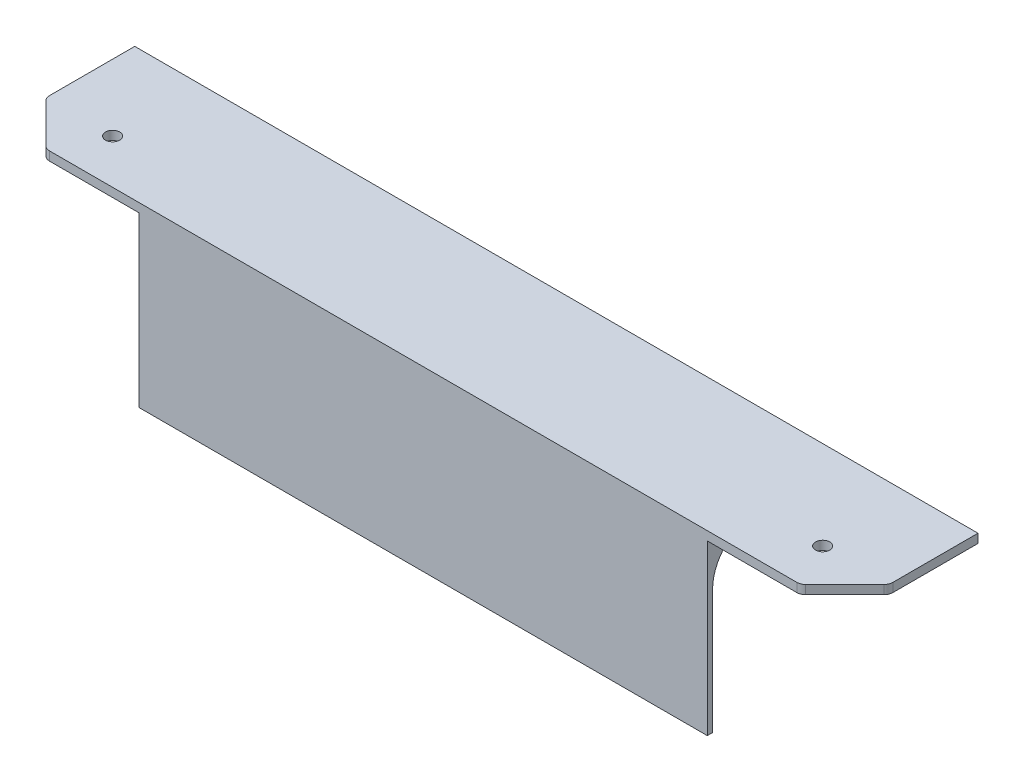
ISO-10303-21;
HEADER;
FILE_DESCRIPTION(('STEP AP214'),'2;1');
FILE_NAME('part.step','',(''),(''),'','','');
FILE_SCHEMA(('AUTOMOTIVE_DESIGN { 1 0 10303 214 1 1 1 1 }'));
ENDSEC;
DATA;
#1=APPLICATION_CONTEXT('core data for automotive mechanical design processes');
#2=APPLICATION_PROTOCOL_DEFINITION('international standard','automotive_design',2000,#1);
#3=PRODUCT_CONTEXT('',#1,'mechanical');
#4=PRODUCT('Part','Part','',(#3));
#5=PRODUCT_RELATED_PRODUCT_CATEGORY('part','',(#4));
#6=PRODUCT_DEFINITION_FORMATION('','',#4);
#7=PRODUCT_DEFINITION_CONTEXT('part definition',#1,'design');
#8=PRODUCT_DEFINITION('design','',#6,#7);
#9=PRODUCT_DEFINITION_SHAPE('','',#8);
#10=(LENGTH_UNIT() NAMED_UNIT(*) SI_UNIT(.MILLI.,.METRE.));
#11=(NAMED_UNIT(*) PLANE_ANGLE_UNIT() SI_UNIT($,.RADIAN.));
#12=(NAMED_UNIT(*) SI_UNIT($,.STERADIAN.) SOLID_ANGLE_UNIT());
#13=UNCERTAINTY_MEASURE_WITH_UNIT(LENGTH_MEASURE(1.E-05),#10,'distance_accuracy_value','');
#14=(GEOMETRIC_REPRESENTATION_CONTEXT(3) GLOBAL_UNCERTAINTY_ASSIGNED_CONTEXT((#13)) GLOBAL_UNIT_ASSIGNED_CONTEXT((#10,
#11,#12)) REPRESENTATION_CONTEXT('',''));
#15=CARTESIAN_POINT('',(0.,0.,0.));
#16=DIRECTION('',(0.,0.,1.));
#17=DIRECTION('',(1.,0.,0.));
#18=AXIS2_PLACEMENT_3D('',#15,#16,#17);
#19=CARTESIAN_POINT('',(95.,2.,15.));
#20=DIRECTION('',(-1.,0.,0.));
#21=DIRECTION('',(0.,0.,1.));
#22=AXIS2_PLACEMENT_3D('',#19,#20,#21);
#23=PLANE('',#22);
#24=DIRECTION('',(0.,0.,-1.));
#25=VECTOR('',#24,1.);
#26=CARTESIAN_POINT('',(95.,2.,15.));
#27=LINE('',#26,#25);
#28=CARTESIAN_POINT('',(95.,2.,4.17157287525383));
#29=VERTEX_POINT('',#28);
#30=CARTESIAN_POINT('',(95.,2.,-15.));
#31=VERTEX_POINT('',#30);
#32=EDGE_CURVE('E188',#29,#31,#27,.T.);
#33=ORIENTED_EDGE('',*,*,#32,.F.);
#34=DIRECTION('',(0.,1.,0.));
#35=VECTOR('',#34,1.);
#36=CARTESIAN_POINT('',(95.,0.,4.17157287525383));
#37=LINE('',#36,#35);
#38=CARTESIAN_POINT('',(95.,0.,4.17157287525383));
#39=VERTEX_POINT('',#38);
#40=EDGE_CURVE('E278',#29,#39,#37,.F.);
#41=ORIENTED_EDGE('',*,*,#40,.T.);
#42=DIRECTION('',(0.,0.,-1.));
#43=VECTOR('',#42,1.);
#44=CARTESIAN_POINT('',(95.,0.,15.));
#45=LINE('',#44,#43);
#46=CARTESIAN_POINT('',(95.,0.,-15.));
#47=VERTEX_POINT('',#46);
#48=EDGE_CURVE('E178',#39,#47,#45,.T.);
#49=ORIENTED_EDGE('',*,*,#48,.T.);
#50=DIRECTION('',(0.,-1.,0.));
#51=VECTOR('',#50,1.);
#52=CARTESIAN_POINT('',(95.,2.,-15.));
#53=LINE('',#52,#51);
#54=EDGE_CURVE('E216',#31,#47,#53,.T.);
#55=ORIENTED_EDGE('',*,*,#54,.F.);
#56=EDGE_LOOP('',(#33,#41,#49,#55));
#57=FACE_BOUND('',#56,.T.);
#58=ADVANCED_FACE('F45',(#57),#23,.F.);
#59=CARTESIAN_POINT('',(-95.,2.,-15.));
#60=DIRECTION('',(0.,0.,1.));
#61=DIRECTION('',(1.,0.,0.));
#62=AXIS2_PLACEMENT_3D('',#59,#60,#61);
#63=PLANE('',#62);
#64=DIRECTION('',(-1.,0.,0.));
#65=VECTOR('',#64,1.);
#66=CARTESIAN_POINT('',(-95.,0.,-15.));
#67=LINE('',#66,#65);
#68=CARTESIAN_POINT('',(-95.,0.,-15.));
#69=VERTEX_POINT('',#68);
#70=EDGE_CURVE('E182',#47,#69,#67,.T.);
#71=ORIENTED_EDGE('',*,*,#70,.T.);
#72=DIRECTION('',(0.,-1.,0.));
#73=VECTOR('',#72,1.);
#74=CARTESIAN_POINT('',(-95.,2.,-15.));
#75=LINE('',#74,#73);
#76=CARTESIAN_POINT('',(-95.,2.,-15.));
#77=VERTEX_POINT('',#76);
#78=EDGE_CURVE('E202',#77,#69,#75,.T.);
#79=ORIENTED_EDGE('',*,*,#78,.F.);
#80=DIRECTION('',(-1.,0.,0.));
#81=VECTOR('',#80,1.);
#82=CARTESIAN_POINT('',(-95.,2.,-15.));
#83=LINE('',#82,#81);
#84=EDGE_CURVE('E191',#31,#77,#83,.T.);
#85=ORIENTED_EDGE('',*,*,#84,.F.);
#86=ORIENTED_EDGE('',*,*,#54,.T.);
#87=EDGE_LOOP('',(#71,#79,#85,#86));
#88=FACE_BOUND('',#87,.T.);
#89=ADVANCED_FACE('F374',(#88),#63,.F.);
#90=CARTESIAN_POINT('',(-95.,2.,15.));
#91=DIRECTION('',(1.,0.,0.));
#92=DIRECTION('',(0.,0.,-1.));
#93=AXIS2_PLACEMENT_3D('',#90,#91,#92);
#94=PLANE('',#93);
#95=DIRECTION('',(0.,0.,1.));
#96=VECTOR('',#95,1.);
#97=CARTESIAN_POINT('',(-95.,0.,15.));
#98=LINE('',#97,#96);
#99=CARTESIAN_POINT('',(-95.,0.,4.17157287525377));
#100=VERTEX_POINT('',#99);
#101=EDGE_CURVE('E206',#69,#100,#98,.T.);
#102=ORIENTED_EDGE('',*,*,#101,.T.);
#103=DIRECTION('',(0.,-1.,0.));
#104=VECTOR('',#103,1.);
#105=CARTESIAN_POINT('',(-95.,2.,4.17157287525377));
#106=LINE('',#105,#104);
#107=CARTESIAN_POINT('',(-95.,2.,4.17157287525377));
#108=VERTEX_POINT('',#107);
#109=EDGE_CURVE('E274',#100,#108,#106,.F.);
#110=ORIENTED_EDGE('',*,*,#109,.T.);
#111=DIRECTION('',(0.,0.,1.));
#112=VECTOR('',#111,1.);
#113=CARTESIAN_POINT('',(-95.,2.,15.));
#114=LINE('',#113,#112);
#115=EDGE_CURVE('E195',#77,#108,#114,.T.);
#116=ORIENTED_EDGE('',*,*,#115,.F.);
#117=ORIENTED_EDGE('',*,*,#78,.T.);
#118=EDGE_LOOP('',(#102,#110,#116,#117));
#119=FACE_BOUND('',#118,.T.);
#120=ADVANCED_FACE('F378',(#119),#94,.F.);
#121=CARTESIAN_POINT('',(-95.,2.,15.));
#122=DIRECTION('',(0.,0.,-1.));
#123=DIRECTION('',(-1.,0.,0.));
#124=AXIS2_PLACEMENT_3D('',#121,#122,#123);
#125=PLANE('',#124);
#126=DIRECTION('',(1.,0.,0.));
#127=VECTOR('',#126,1.);
#128=CARTESIAN_POINT('',(-95.,2.,15.));
#129=LINE('',#128,#127);
#130=CARTESIAN_POINT('',(-84.1715728752538,2.,15.));
#131=VERTEX_POINT('',#130);
#132=CARTESIAN_POINT('',(84.1715728752538,2.,15.));
#133=VERTEX_POINT('',#132);
#134=EDGE_CURVE('E199',#131,#133,#129,.T.);
#135=ORIENTED_EDGE('',*,*,#134,.F.);
#136=DIRECTION('',(0.,1.,0.));
#137=VECTOR('',#136,1.);
#138=CARTESIAN_POINT('',(-84.1715728752538,0.,15.));
#139=LINE('',#138,#137);
#140=CARTESIAN_POINT('',(-84.1715728752538,0.,15.));
#141=VERTEX_POINT('',#140);
#142=EDGE_CURVE('E240',#131,#141,#139,.F.);
#143=ORIENTED_EDGE('',*,*,#142,.T.);
#144=DIRECTION('',(1.,0.,0.));
#145=VECTOR('',#144,1.);
#146=CARTESIAN_POINT('',(-95.,0.,15.));
#147=LINE('',#146,#145);
#148=CARTESIAN_POINT('',(-64.,0.,15.));
#149=VERTEX_POINT('',#148);
#150=EDGE_CURVE('E192',#141,#149,#147,.T.);
#151=ORIENTED_EDGE('',*,*,#150,.T.);
#152=DIRECTION('',(0.,1.,0.));
#153=VECTOR('',#152,1.);
#154=CARTESIAN_POINT('',(-64.,-38.,15.));
#155=LINE('',#154,#153);
#156=CARTESIAN_POINT('',(-64.,-38.,15.));
#157=VERTEX_POINT('',#156);
#158=EDGE_CURVE('E313',#157,#149,#155,.T.);
#159=ORIENTED_EDGE('',*,*,#158,.F.);
#160=DIRECTION('',(-1.,0.,0.));
#161=VECTOR('',#160,1.);
#162=CARTESIAN_POINT('',(-64.,-38.,15.));
#163=LINE('',#162,#161);
#164=CARTESIAN_POINT('',(64.,-38.,15.));
#165=VERTEX_POINT('',#164);
#166=EDGE_CURVE('E171',#165,#157,#163,.T.);
#167=ORIENTED_EDGE('',*,*,#166,.F.);
#168=DIRECTION('',(0.,1.,0.));
#169=VECTOR('',#168,1.);
#170=CARTESIAN_POINT('',(64.,-38.,15.));
#171=LINE('',#170,#169);
#172=CARTESIAN_POINT('',(64.,0.,15.));
#173=VERTEX_POINT('',#172);
#174=EDGE_CURVE('E184',#165,#173,#171,.T.);
#175=ORIENTED_EDGE('',*,*,#174,.T.);
#176=CARTESIAN_POINT('',(84.1715728752538,0.,15.));
#177=VERTEX_POINT('',#176);
#178=EDGE_CURVE('E210',#173,#177,#147,.T.);
#179=ORIENTED_EDGE('',*,*,#178,.T.);
#180=DIRECTION('',(0.,-1.,0.));
#181=VECTOR('',#180,1.);
#182=CARTESIAN_POINT('',(84.1715728752538,2.,15.));
#183=LINE('',#182,#181);
#184=EDGE_CURVE('E236',#177,#133,#183,.F.);
#185=ORIENTED_EDGE('',*,*,#184,.T.);
#186=EDGE_LOOP('',(#135,#143,#151,#159,#167,#175,#179,#185));
#187=FACE_BOUND('',#186,.T.);
#188=ADVANCED_FACE('F338',(#187),#125,.F.);
#189=CARTESIAN_POINT('',(0.,2.,0.));
#190=DIRECTION('',(0.,-1.,0.));
#191=DIRECTION('',(0.,0.,-1.));
#192=AXIS2_PLACEMENT_3D('',#189,#190,#191);
#193=PLANE('',#192);
#194=CARTESIAN_POINT('',(-80.,2.,5.));
#195=DIRECTION('',(0.,1.,0.));
#196=DIRECTION('',(0.,0.,1.));
#197=AXIS2_PLACEMENT_3D('',#194,#195,#196);
#198=CIRCLE('',#197,1.60000000000001);
#199=CARTESIAN_POINT('',(-80.,2.,6.6));
#200=VERTEX_POINT('',#199);
#201=EDGE_CURVE('E294',#200,#200,#198,.T.);
#202=ORIENTED_EDGE('',*,*,#201,.F.);
#203=EDGE_LOOP('',(#202));
#204=FACE_BOUND('',#203,.T.);
#205=CARTESIAN_POINT('',(80.,2.,5.));
#206=DIRECTION('',(0.,1.,0.));
#207=DIRECTION('',(0.,0.,1.));
#208=AXIS2_PLACEMENT_3D('',#205,#206,#207);
#209=CIRCLE('',#208,1.60000000000001);
#210=CARTESIAN_POINT('',(80.,2.,6.6));
#211=VERTEX_POINT('',#210);
#212=EDGE_CURVE('E325',#211,#211,#209,.T.);
#213=ORIENTED_EDGE('',*,*,#212,.F.);
#214=EDGE_LOOP('',(#213));
#215=FACE_BOUND('',#214,.T.);
#216=DIRECTION('',(-0.707106781186546,0.,-0.70710678118655));
#217=VECTOR('',#216,1.);
#218=CARTESIAN_POINT('',(-85.,2.,15.));
#219=LINE('',#218,#217);
#220=CARTESIAN_POINT('',(-94.4142135623731,2.,5.58578643762686));
#221=VERTEX_POINT('',#220);
#222=CARTESIAN_POINT('',(-85.5857864376269,2.,14.4142135623731));
#223=VERTEX_POINT('',#222);
#224=EDGE_CURVE('E228',#221,#223,#219,.F.);
#225=ORIENTED_EDGE('',*,*,#224,.T.);
#226=CARTESIAN_POINT('',(-84.1715728752538,2.,13.));
#227=DIRECTION('',(0.,-1.,0.));
#228=DIRECTION('',(0.,0.,-1.));
#229=AXIS2_PLACEMENT_3D('',#226,#227,#228);
#230=CIRCLE('',#229,2.);
#231=EDGE_CURVE('E271',#223,#131,#230,.F.);
#232=ORIENTED_EDGE('',*,*,#231,.T.);
#233=ORIENTED_EDGE('',*,*,#134,.T.);
#234=CARTESIAN_POINT('',(84.1715728752538,2.,13.));
#235=DIRECTION('',(0.,-1.,0.));
#236=DIRECTION('',(0.,0.,-1.));
#237=AXIS2_PLACEMENT_3D('',#234,#235,#236);
#238=CIRCLE('',#237,2.);
#239=CARTESIAN_POINT('',(85.5857864376269,2.,14.4142135623731));
#240=VERTEX_POINT('',#239);
#241=EDGE_CURVE('E262',#133,#240,#238,.F.);
#242=ORIENTED_EDGE('',*,*,#241,.T.);
#243=DIRECTION('',(-0.70710678118655,0.,0.707106781186546));
#244=VECTOR('',#243,1.);
#245=CARTESIAN_POINT('',(95.,2.,5.00000000000002));
#246=LINE('',#245,#244);
#247=CARTESIAN_POINT('',(94.4142135623731,2.,5.58578643762692));
#248=VERTEX_POINT('',#247);
#249=EDGE_CURVE('E232',#240,#248,#246,.F.);
#250=ORIENTED_EDGE('',*,*,#249,.T.);
#251=CARTESIAN_POINT('',(93.,2.,4.17157287525383));
#252=DIRECTION('',(0.,-1.,0.));
#253=DIRECTION('',(0.,0.,-1.));
#254=AXIS2_PLACEMENT_3D('',#251,#252,#253);
#255=CIRCLE('',#254,2.);
#256=EDGE_CURVE('E265',#248,#29,#255,.F.);
#257=ORIENTED_EDGE('',*,*,#256,.T.);
#258=ORIENTED_EDGE('',*,*,#32,.T.);
#259=ORIENTED_EDGE('',*,*,#84,.T.);
#260=ORIENTED_EDGE('',*,*,#115,.T.);
#261=CARTESIAN_POINT('',(-93.,2.,4.17157287525377));
#262=DIRECTION('',(0.,-1.,0.));
#263=DIRECTION('',(0.,0.,-1.));
#264=AXIS2_PLACEMENT_3D('',#261,#262,#263);
#265=CIRCLE('',#264,2.);
#266=EDGE_CURVE('E268',#108,#221,#265,.F.);
#267=ORIENTED_EDGE('',*,*,#266,.T.);
#268=EDGE_LOOP('',(#225,#232,#233,#242,#250,#257,#258,#259,#260,#267));
#269=FACE_BOUND('',#268,.T.);
#270=ADVANCED_FACE('F335',(#204,#215,#269),#193,.F.);
#271=CARTESIAN_POINT('',(0.,0.,0.));
#272=DIRECTION('',(0.,-1.,0.));
#273=DIRECTION('',(0.,0.,-1.));
#274=AXIS2_PLACEMENT_3D('',#271,#272,#273);
#275=PLANE('',#274);
#276=CARTESIAN_POINT('',(-80.,0.,5.));
#277=DIRECTION('',(0.,-1.,0.));
#278=DIRECTION('',(0.,0.,-1.));
#279=AXIS2_PLACEMENT_3D('',#276,#277,#278);
#280=CIRCLE('',#279,1.60000000000001);
#281=CARTESIAN_POINT('',(-80.,0.,3.39999999999999));
#282=VERTEX_POINT('',#281);
#283=EDGE_CURVE('E293',#282,#282,#280,.T.);
#284=ORIENTED_EDGE('',*,*,#283,.F.);
#285=EDGE_LOOP('',(#284));
#286=FACE_BOUND('',#285,.T.);
#287=CARTESIAN_POINT('',(80.,0.,5.));
#288=DIRECTION('',(0.,-1.,0.));
#289=DIRECTION('',(0.,0.,-1.));
#290=AXIS2_PLACEMENT_3D('',#287,#288,#289);
#291=CIRCLE('',#290,1.60000000000001);
#292=CARTESIAN_POINT('',(80.,0.,3.39999999999999));
#293=VERTEX_POINT('',#292);
#294=EDGE_CURVE('E289',#293,#293,#291,.T.);
#295=ORIENTED_EDGE('',*,*,#294,.F.);
#296=EDGE_LOOP('',(#295));
#297=FACE_BOUND('',#296,.T.);
#298=DIRECTION('',(0.,0.,1.));
#299=VECTOR('',#298,1.);
#300=CARTESIAN_POINT('',(64.,0.,15.));
#301=LINE('',#300,#299);
#302=CARTESIAN_POINT('',(64.,0.,3.8));
#303=VERTEX_POINT('',#302);
#304=EDGE_CURVE('E61',#303,#173,#301,.T.);
#305=ORIENTED_EDGE('',*,*,#304,.F.);
#306=DIRECTION('',(1.,0.,0.));
#307=VECTOR('',#306,1.);
#308=CARTESIAN_POINT('',(0.,0.,3.8));
#309=LINE('',#308,#307);
#310=CARTESIAN_POINT('',(-64.,0.,3.8));
#311=VERTEX_POINT('',#310);
#312=EDGE_CURVE('E300',#303,#311,#309,.F.);
#313=ORIENTED_EDGE('',*,*,#312,.T.);
#314=DIRECTION('',(0.,0.,-1.));
#315=VECTOR('',#314,1.);
#316=CARTESIAN_POINT('',(-64.,0.,15.));
#317=LINE('',#316,#315);
#318=EDGE_CURVE('E68',#149,#311,#317,.T.);
#319=ORIENTED_EDGE('',*,*,#318,.F.);
#320=ORIENTED_EDGE('',*,*,#150,.F.);
#321=CARTESIAN_POINT('',(-84.1715728752538,0.,13.));
#322=DIRECTION('',(0.,-1.,0.));
#323=DIRECTION('',(0.,0.,-1.));
#324=AXIS2_PLACEMENT_3D('',#321,#322,#323);
#325=CIRCLE('',#324,2.);
#326=CARTESIAN_POINT('',(-85.5857864376269,0.,14.4142135623731));
#327=VERTEX_POINT('',#326);
#328=EDGE_CURVE('E253',#141,#327,#325,.T.);
#329=ORIENTED_EDGE('',*,*,#328,.T.);
#330=DIRECTION('',(0.707106781186546,0.,0.70710678118655));
#331=VECTOR('',#330,1.);
#332=CARTESIAN_POINT('',(-50.0000000000002,0.,50.));
#333=LINE('',#332,#331);
#334=CARTESIAN_POINT('',(-94.4142135623731,0.,5.58578643762686));
#335=VERTEX_POINT('',#334);
#336=EDGE_CURVE('E220',#327,#335,#333,.F.);
#337=ORIENTED_EDGE('',*,*,#336,.T.);
#338=CARTESIAN_POINT('',(-93.,0.,4.17157287525377));
#339=DIRECTION('',(0.,-1.,0.));
#340=DIRECTION('',(0.,0.,-1.));
#341=AXIS2_PLACEMENT_3D('',#338,#339,#340);
#342=CIRCLE('',#341,2.);
#343=EDGE_CURVE('E250',#335,#100,#342,.T.);
#344=ORIENTED_EDGE('',*,*,#343,.T.);
#345=ORIENTED_EDGE('',*,*,#101,.F.);
#346=ORIENTED_EDGE('',*,*,#70,.F.);
#347=ORIENTED_EDGE('',*,*,#48,.F.);
#348=CARTESIAN_POINT('',(93.,0.,4.17157287525383));
#349=DIRECTION('',(0.,-1.,0.));
#350=DIRECTION('',(0.,0.,-1.));
#351=AXIS2_PLACEMENT_3D('',#348,#349,#350);
#352=CIRCLE('',#351,2.);
#353=CARTESIAN_POINT('',(94.4142135623731,0.,5.58578643762692));
#354=VERTEX_POINT('',#353);
#355=EDGE_CURVE('E247',#39,#354,#352,.T.);
#356=ORIENTED_EDGE('',*,*,#355,.T.);
#357=DIRECTION('',(0.70710678118655,0.,-0.707106781186546));
#358=VECTOR('',#357,1.);
#359=CARTESIAN_POINT('',(49.9999999999997,0.,50.));
#360=LINE('',#359,#358);
#361=CARTESIAN_POINT('',(85.5857864376269,0.,14.4142135623731));
#362=VERTEX_POINT('',#361);
#363=EDGE_CURVE('E224',#354,#362,#360,.F.);
#364=ORIENTED_EDGE('',*,*,#363,.T.);
#365=CARTESIAN_POINT('',(84.1715728752538,0.,13.));
#366=DIRECTION('',(0.,-1.,0.));
#367=DIRECTION('',(0.,0.,-1.));
#368=AXIS2_PLACEMENT_3D('',#365,#366,#367);
#369=CIRCLE('',#368,2.);
#370=EDGE_CURVE('E244',#362,#177,#369,.T.);
#371=ORIENTED_EDGE('',*,*,#370,.T.);
#372=ORIENTED_EDGE('',*,*,#178,.F.);
#373=EDGE_LOOP('',(#305,#313,#319,#320,#329,#337,#344,#345,#346,#347,#356,#364,#371,#372));
#374=FACE_BOUND('',#373,.T.);
#375=ADVANCED_FACE('F309',(#286,#297,#374),#275,.T.);
#376=CARTESIAN_POINT('',(-64.,-38.,15.));
#377=DIRECTION('',(1.,0.,0.));
#378=DIRECTION('',(0.,0.,-1.));
#379=AXIS2_PLACEMENT_3D('',#376,#377,#378);
#380=PLANE('',#379);
#381=ORIENTED_EDGE('',*,*,#318,.T.);
#382=CARTESIAN_POINT('',(-64.,-10.,3.8));
#383=DIRECTION('',(1.,0.,0.));
#384=DIRECTION('',(0.,0.,-1.));
#385=AXIS2_PLACEMENT_3D('',#382,#383,#384);
#386=CIRCLE('',#385,10.);
#387=CARTESIAN_POINT('',(-64.,-10.,13.8));
#388=VERTEX_POINT('',#387);
#389=EDGE_CURVE('E11',#311,#388,#386,.T.);
#390=ORIENTED_EDGE('',*,*,#389,.T.);
#391=DIRECTION('',(0.,1.,0.));
#392=VECTOR('',#391,1.);
#393=CARTESIAN_POINT('',(-64.,-38.,13.8));
#394=LINE('',#393,#392);
#395=CARTESIAN_POINT('',(-64.,-38.,13.8));
#396=VERTEX_POINT('',#395);
#397=EDGE_CURVE('E158',#396,#388,#394,.T.);
#398=ORIENTED_EDGE('',*,*,#397,.F.);
#399=DIRECTION('',(0.,0.,-1.));
#400=VECTOR('',#399,1.);
#401=CARTESIAN_POINT('',(-64.,-38.,15.));
#402=LINE('',#401,#400);
#403=EDGE_CURVE('E166',#157,#396,#402,.T.);
#404=ORIENTED_EDGE('',*,*,#403,.F.);
#405=ORIENTED_EDGE('',*,*,#158,.T.);
#406=EDGE_LOOP('',(#381,#390,#398,#404,#405));
#407=FACE_BOUND('',#406,.T.);
#408=ADVANCED_FACE('F175',(#407),#380,.F.);
#409=CARTESIAN_POINT('',(-64.,-38.,13.8));
#410=DIRECTION('',(0.,0.,1.));
#411=DIRECTION('',(1.,0.,0.));
#412=AXIS2_PLACEMENT_3D('',#409,#410,#411);
#413=PLANE('',#412);
#414=ORIENTED_EDGE('',*,*,#397,.T.);
#415=DIRECTION('',(1.,0.,0.));
#416=VECTOR('',#415,1.);
#417=CARTESIAN_POINT('',(-64.,-10.,13.8));
#418=LINE('',#417,#416);
#419=CARTESIAN_POINT('',(64.,-10.,13.8));
#420=VERTEX_POINT('',#419);
#421=EDGE_CURVE('E288',#388,#420,#418,.T.);
#422=ORIENTED_EDGE('',*,*,#421,.T.);
#423=DIRECTION('',(0.,1.,0.));
#424=VECTOR('',#423,1.);
#425=CARTESIAN_POINT('',(64.,-38.,13.8));
#426=LINE('',#425,#424);
#427=CARTESIAN_POINT('',(64.,-38.,13.8));
#428=VERTEX_POINT('',#427);
#429=EDGE_CURVE('E161',#428,#420,#426,.T.);
#430=ORIENTED_EDGE('',*,*,#429,.F.);
#431=DIRECTION('',(1.,0.,0.));
#432=VECTOR('',#431,1.);
#433=CARTESIAN_POINT('',(-64.,-38.,13.8));
#434=LINE('',#433,#432);
#435=EDGE_CURVE('E153',#396,#428,#434,.T.);
#436=ORIENTED_EDGE('',*,*,#435,.F.);
#437=EDGE_LOOP('',(#414,#422,#430,#436));
#438=FACE_BOUND('',#437,.T.);
#439=ADVANCED_FACE('F155',(#438),#413,.F.);
#440=CARTESIAN_POINT('',(64.,-38.,15.));
#441=DIRECTION('',(-1.,0.,0.));
#442=DIRECTION('',(0.,0.,1.));
#443=AXIS2_PLACEMENT_3D('',#440,#441,#442);
#444=PLANE('',#443);
#445=ORIENTED_EDGE('',*,*,#304,.T.);
#446=ORIENTED_EDGE('',*,*,#174,.F.);
#447=DIRECTION('',(0.,0.,1.));
#448=VECTOR('',#447,1.);
#449=CARTESIAN_POINT('',(64.,-38.,15.));
#450=LINE('',#449,#448);
#451=EDGE_CURVE('E165',#428,#165,#450,.T.);
#452=ORIENTED_EDGE('',*,*,#451,.F.);
#453=ORIENTED_EDGE('',*,*,#429,.T.);
#454=CARTESIAN_POINT('',(64.,-10.,3.8));
#455=DIRECTION('',(-1.,0.,0.));
#456=DIRECTION('',(0.,0.,1.));
#457=AXIS2_PLACEMENT_3D('',#454,#455,#456);
#458=CIRCLE('',#457,10.);
#459=EDGE_CURVE('E54',#420,#303,#458,.T.);
#460=ORIENTED_EDGE('',*,*,#459,.T.);
#461=EDGE_LOOP('',(#445,#446,#452,#453,#460));
#462=FACE_BOUND('',#461,.T.);
#463=ADVANCED_FACE('F305',(#462),#444,.F.);
#464=CARTESIAN_POINT('',(0.,-38.,0.));
#465=DIRECTION('',(0.,-1.,0.));
#466=DIRECTION('',(0.,0.,-1.));
#467=AXIS2_PLACEMENT_3D('',#464,#465,#466);
#468=PLANE('',#467);
#469=ORIENTED_EDGE('',*,*,#403,.T.);
#470=ORIENTED_EDGE('',*,*,#435,.T.);
#471=ORIENTED_EDGE('',*,*,#451,.T.);
#472=ORIENTED_EDGE('',*,*,#166,.T.);
#473=EDGE_LOOP('',(#469,#470,#471,#472));
#474=FACE_BOUND('',#473,.T.);
#475=ADVANCED_FACE('F169',(#474),#468,.T.);
#476=CARTESIAN_POINT('',(95.,2.,5.00000000000002));
#477=DIRECTION('',(-0.707106781186545,0.,-0.707106781186549));
#478=DIRECTION('',(0.,-1.,0.));
#479=AXIS2_PLACEMENT_3D('',#476,#477,#478);
#480=PLANE('',#479);
#481=ORIENTED_EDGE('',*,*,#363,.F.);
#482=DIRECTION('',(0.,-1.,0.));
#483=VECTOR('',#482,1.);
#484=CARTESIAN_POINT('',(94.4142135623731,2.,5.58578643762692));
#485=LINE('',#484,#483);
#486=EDGE_CURVE('E285',#354,#248,#485,.F.);
#487=ORIENTED_EDGE('',*,*,#486,.T.);
#488=ORIENTED_EDGE('',*,*,#249,.F.);
#489=DIRECTION('',(0.,1.,0.));
#490=VECTOR('',#489,1.);
#491=CARTESIAN_POINT('',(85.5857864376269,0.,14.4142135623731));
#492=LINE('',#491,#490);
#493=EDGE_CURVE('E282',#240,#362,#492,.F.);
#494=ORIENTED_EDGE('',*,*,#493,.T.);
#495=EDGE_LOOP('',(#481,#487,#488,#494));
#496=FACE_BOUND('',#495,.T.);
#497=ADVANCED_FACE('F359',(#496),#480,.F.);
#498=CARTESIAN_POINT('',(-85.,2.,15.));
#499=DIRECTION('',(0.707106781186549,0.,-0.707106781186545));
#500=DIRECTION('',(0.,-1.,0.));
#501=AXIS2_PLACEMENT_3D('',#498,#499,#500);
#502=PLANE('',#501);
#503=ORIENTED_EDGE('',*,*,#336,.F.);
#504=DIRECTION('',(0.,-1.,0.));
#505=VECTOR('',#504,1.);
#506=CARTESIAN_POINT('',(-85.5857864376269,2.,14.4142135623731));
#507=LINE('',#506,#505);
#508=EDGE_CURVE('E259',#327,#223,#507,.F.);
#509=ORIENTED_EDGE('',*,*,#508,.T.);
#510=ORIENTED_EDGE('',*,*,#224,.F.);
#511=DIRECTION('',(0.,1.,0.));
#512=VECTOR('',#511,1.);
#513=CARTESIAN_POINT('',(-94.4142135623731,0.,5.58578643762686));
#514=LINE('',#513,#512);
#515=EDGE_CURVE('E256',#221,#335,#514,.F.);
#516=ORIENTED_EDGE('',*,*,#515,.T.);
#517=EDGE_LOOP('',(#503,#509,#510,#516));
#518=FACE_BOUND('',#517,.T.);
#519=ADVANCED_FACE('F385',(#518),#502,.F.);
#520=CARTESIAN_POINT('',(-84.1715728752538,2.,13.));
#521=DIRECTION('',(0.,-1.,0.));
#522=DIRECTION('',(0.,0.,-1.));
#523=AXIS2_PLACEMENT_3D('',#520,#521,#522);
#524=CYLINDRICAL_SURFACE('',#523,2.);
#525=ORIENTED_EDGE('',*,*,#231,.F.);
#526=ORIENTED_EDGE('',*,*,#508,.F.);
#527=ORIENTED_EDGE('',*,*,#328,.F.);
#528=ORIENTED_EDGE('',*,*,#142,.F.);
#529=EDGE_LOOP('',(#525,#526,#527,#528));
#530=FACE_BOUND('',#529,.T.);
#531=ADVANCED_FACE('F350',(#530),#524,.T.);
#532=CARTESIAN_POINT('',(-93.,2.,4.17157287525377));
#533=DIRECTION('',(0.,1.,0.));
#534=DIRECTION('',(0.,0.,1.));
#535=AXIS2_PLACEMENT_3D('',#532,#533,#534);
#536=CYLINDRICAL_SURFACE('',#535,2.);
#537=ORIENTED_EDGE('',*,*,#343,.F.);
#538=ORIENTED_EDGE('',*,*,#515,.F.);
#539=ORIENTED_EDGE('',*,*,#266,.F.);
#540=ORIENTED_EDGE('',*,*,#109,.F.);
#541=EDGE_LOOP('',(#537,#538,#539,#540));
#542=FACE_BOUND('',#541,.T.);
#543=ADVANCED_FACE('F383',(#542),#536,.T.);
#544=CARTESIAN_POINT('',(93.,2.,4.17157287525383));
#545=DIRECTION('',(0.,-1.,0.));
#546=DIRECTION('',(0.,0.,-1.));
#547=AXIS2_PLACEMENT_3D('',#544,#545,#546);
#548=CYLINDRICAL_SURFACE('',#547,2.);
#549=ORIENTED_EDGE('',*,*,#256,.F.);
#550=ORIENTED_EDGE('',*,*,#486,.F.);
#551=ORIENTED_EDGE('',*,*,#355,.F.);
#552=ORIENTED_EDGE('',*,*,#40,.F.);
#553=EDGE_LOOP('',(#549,#550,#551,#552));
#554=FACE_BOUND('',#553,.T.);
#555=ADVANCED_FACE('F366',(#554),#548,.T.);
#556=CARTESIAN_POINT('',(84.1715728752538,2.,13.));
#557=DIRECTION('',(0.,1.,0.));
#558=DIRECTION('',(0.,0.,1.));
#559=AXIS2_PLACEMENT_3D('',#556,#557,#558);
#560=CYLINDRICAL_SURFACE('',#559,2.);
#561=ORIENTED_EDGE('',*,*,#370,.F.);
#562=ORIENTED_EDGE('',*,*,#493,.F.);
#563=ORIENTED_EDGE('',*,*,#241,.F.);
#564=ORIENTED_EDGE('',*,*,#184,.F.);
#565=EDGE_LOOP('',(#561,#562,#563,#564));
#566=FACE_BOUND('',#565,.T.);
#567=ADVANCED_FACE('F362',(#566),#560,.T.);
#568=CARTESIAN_POINT('',(80.,-38.,5.));
#569=DIRECTION('',(0.,1.,0.));
#570=DIRECTION('',(0.,0.,1.));
#571=AXIS2_PLACEMENT_3D('',#568,#569,#570);
#572=CYLINDRICAL_SURFACE('',#571,1.60000000000001);
#573=ORIENTED_EDGE('',*,*,#294,.T.);
#574=EDGE_LOOP('',(#573));
#575=FACE_BOUND('',#574,.T.);
#576=ORIENTED_EDGE('',*,*,#212,.T.);
#577=EDGE_LOOP('',(#576));
#578=FACE_BOUND('',#577,.T.);
#579=ADVANCED_FACE('F422',(#575,#578),#572,.F.);
#580=CARTESIAN_POINT('',(-80.,-38.,5.));
#581=DIRECTION('',(0.,1.,0.));
#582=DIRECTION('',(0.,0.,1.));
#583=AXIS2_PLACEMENT_3D('',#580,#581,#582);
#584=CYLINDRICAL_SURFACE('',#583,1.60000000000001);
#585=ORIENTED_EDGE('',*,*,#283,.T.);
#586=EDGE_LOOP('',(#585));
#587=FACE_BOUND('',#586,.T.);
#588=ORIENTED_EDGE('',*,*,#201,.T.);
#589=EDGE_LOOP('',(#588));
#590=FACE_BOUND('',#589,.T.);
#591=ADVANCED_FACE('F333',(#587,#590),#584,.F.);
#592=CARTESIAN_POINT('',(-64.,-10.,3.8));
#593=DIRECTION('',(1.,0.,0.));
#594=DIRECTION('',(0.,0.,-1.));
#595=AXIS2_PLACEMENT_3D('',#592,#593,#594);
#596=CYLINDRICAL_SURFACE('',#595,10.);
#597=ORIENTED_EDGE('',*,*,#389,.F.);
#598=ORIENTED_EDGE('',*,*,#312,.F.);
#599=ORIENTED_EDGE('',*,*,#459,.F.);
#600=ORIENTED_EDGE('',*,*,#421,.F.);
#601=EDGE_LOOP('',(#597,#598,#599,#600));
#602=FACE_BOUND('',#601,.T.);
#603=ADVANCED_FACE('F47',(#602),#596,.F.);
#604=CLOSED_SHELL('',(#58,#89,#120,#188,#270,#375,#408,#439,#463,#475,#497,#519,#531,#543,#555,
#567,#579,#591,#603));
#605=MANIFOLD_SOLID_BREP('B2',#604);
#606=ADVANCED_BREP_SHAPE_REPRESENTATION('',(#18,#605),#14);
#607=SHAPE_DEFINITION_REPRESENTATION(#9,#606);
ENDSEC;
END-ISO-10303-21;
